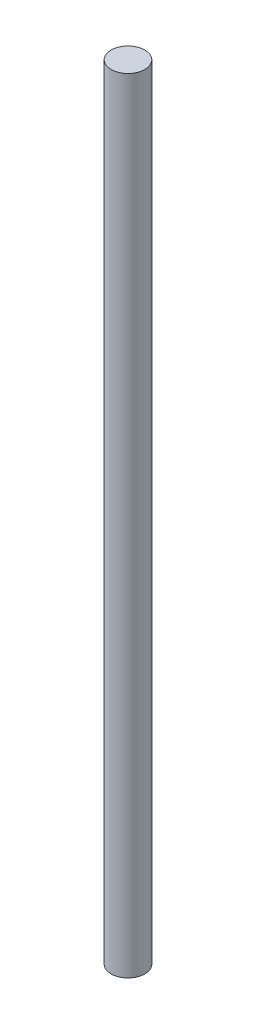
ISO-10303-21;
HEADER;
FILE_DESCRIPTION(('STEP AP214'),'2;1');
FILE_NAME('part.step','',(''),(''),'','','');
FILE_SCHEMA(('AUTOMOTIVE_DESIGN { 1 0 10303 214 1 1 1 1 }'));
ENDSEC;
DATA;
#1=APPLICATION_CONTEXT('core data for automotive mechanical design processes');
#2=APPLICATION_PROTOCOL_DEFINITION('international standard','automotive_design',2000,#1);
#3=PRODUCT_CONTEXT('',#1,'mechanical');
#4=PRODUCT('Part','Part','',(#3));
#5=PRODUCT_RELATED_PRODUCT_CATEGORY('part','',(#4));
#6=PRODUCT_DEFINITION_FORMATION('','',#4);
#7=PRODUCT_DEFINITION_CONTEXT('part definition',#1,'design');
#8=PRODUCT_DEFINITION('design','',#6,#7);
#9=PRODUCT_DEFINITION_SHAPE('','',#8);
#10=(LENGTH_UNIT() NAMED_UNIT(*) SI_UNIT(.MILLI.,.METRE.));
#11=(NAMED_UNIT(*) PLANE_ANGLE_UNIT() SI_UNIT($,.RADIAN.));
#12=(NAMED_UNIT(*) SI_UNIT($,.STERADIAN.) SOLID_ANGLE_UNIT());
#13=UNCERTAINTY_MEASURE_WITH_UNIT(LENGTH_MEASURE(1.E-05),#10,'distance_accuracy_value','');
#14=(GEOMETRIC_REPRESENTATION_CONTEXT(3) GLOBAL_UNCERTAINTY_ASSIGNED_CONTEXT((#13)) GLOBAL_UNIT_ASSIGNED_CONTEXT((#10,
#11,#12)) REPRESENTATION_CONTEXT('',''));
#15=CARTESIAN_POINT('',(0.,0.,0.));
#16=DIRECTION('',(0.,0.,1.));
#17=DIRECTION('',(1.,0.,0.));
#18=AXIS2_PLACEMENT_3D('',#15,#16,#17);
#19=CARTESIAN_POINT('',(0.,186.,0.));
#20=DIRECTION('',(0.,-1.,0.));
#21=DIRECTION('',(0.,0.,-1.));
#22=AXIS2_PLACEMENT_3D('',#19,#20,#21);
#23=CYLINDRICAL_SURFACE('',#22,4.);
#24=CARTESIAN_POINT('',(0.,186.,0.));
#25=DIRECTION('',(0.,1.,0.));
#26=DIRECTION('',(0.,0.,1.));
#27=AXIS2_PLACEMENT_3D('',#24,#25,#26);
#28=CIRCLE('',#27,4.);
#29=CARTESIAN_POINT('',(0.,186.,4.));
#30=VERTEX_POINT('',#29);
#31=EDGE_CURVE('E10',#30,#30,#28,.T.);
#32=ORIENTED_EDGE('',*,*,#31,.F.);
#33=EDGE_LOOP('',(#32));
#34=FACE_BOUND('',#33,.T.);
#35=CARTESIAN_POINT('',(0.,0.,0.));
#36=DIRECTION('',(0.,1.,0.));
#37=DIRECTION('',(0.,0.,1.));
#38=AXIS2_PLACEMENT_3D('',#35,#36,#37);
#39=CIRCLE('',#38,4.);
#40=CARTESIAN_POINT('',(0.,0.,4.));
#41=VERTEX_POINT('',#40);
#42=EDGE_CURVE('E33',#41,#41,#39,.T.);
#43=ORIENTED_EDGE('',*,*,#42,.T.);
#44=EDGE_LOOP('',(#43));
#45=FACE_BOUND('',#44,.T.);
#46=ADVANCED_FACE('F30',(#34,#45),#23,.T.);
#47=CARTESIAN_POINT('',(0.,186.,0.));
#48=DIRECTION('',(0.,1.,0.));
#49=DIRECTION('',(0.,0.,1.));
#50=AXIS2_PLACEMENT_3D('',#47,#48,#49);
#51=PLANE('',#50);
#52=ORIENTED_EDGE('',*,*,#31,.T.);
#53=EDGE_LOOP('',(#52));
#54=FACE_BOUND('',#53,.T.);
#55=ADVANCED_FACE('F45',(#54),#51,.T.);
#56=CARTESIAN_POINT('',(0.,0.,0.));
#57=DIRECTION('',(0.,1.,0.));
#58=DIRECTION('',(0.,0.,1.));
#59=AXIS2_PLACEMENT_3D('',#56,#57,#58);
#60=PLANE('',#59);
#61=ORIENTED_EDGE('',*,*,#42,.F.);
#62=EDGE_LOOP('',(#61));
#63=FACE_BOUND('',#62,.T.);
#64=ADVANCED_FACE('F43',(#63),#60,.F.);
#65=CLOSED_SHELL('',(#46,#55,#64));
#66=MANIFOLD_SOLID_BREP('B2',#65);
#67=ADVANCED_BREP_SHAPE_REPRESENTATION('',(#18,#66),#14);
#68=SHAPE_DEFINITION_REPRESENTATION(#9,#67);
ENDSEC;
END-ISO-10303-21;
